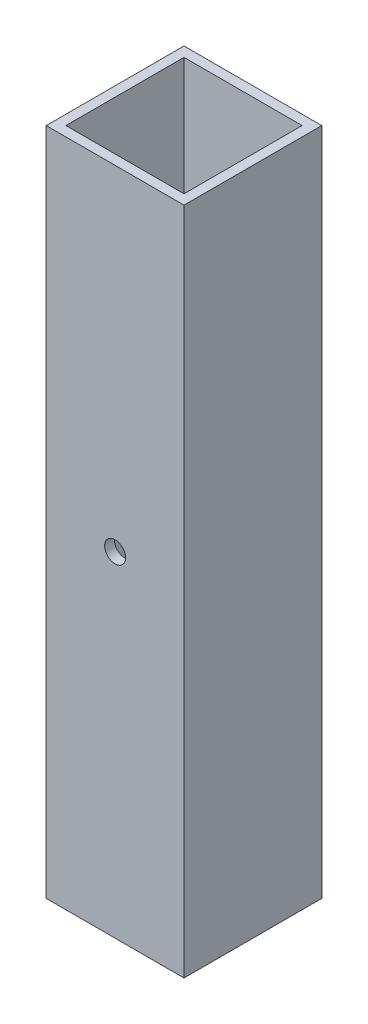
ISO-10303-21;
HEADER;
FILE_DESCRIPTION(('STEP AP214'),'2;1');
FILE_NAME('part.step','',(''),(''),'','','');
FILE_SCHEMA(('AUTOMOTIVE_DESIGN { 1 0 10303 214 1 1 1 1 }'));
ENDSEC;
DATA;
#1=APPLICATION_CONTEXT('core data for automotive mechanical design processes');
#2=APPLICATION_PROTOCOL_DEFINITION('international standard','automotive_design',2000,#1);
#3=PRODUCT_CONTEXT('',#1,'mechanical');
#4=PRODUCT('Part','Part','',(#3));
#5=PRODUCT_RELATED_PRODUCT_CATEGORY('part','',(#4));
#6=PRODUCT_DEFINITION_FORMATION('','',#4);
#7=PRODUCT_DEFINITION_CONTEXT('part definition',#1,'design');
#8=PRODUCT_DEFINITION('design','',#6,#7);
#9=PRODUCT_DEFINITION_SHAPE('','',#8);
#10=(LENGTH_UNIT() NAMED_UNIT(*) SI_UNIT(.MILLI.,.METRE.));
#11=(NAMED_UNIT(*) PLANE_ANGLE_UNIT() SI_UNIT($,.RADIAN.));
#12=(NAMED_UNIT(*) SI_UNIT($,.STERADIAN.) SOLID_ANGLE_UNIT());
#13=UNCERTAINTY_MEASURE_WITH_UNIT(LENGTH_MEASURE(1.E-05),#10,'distance_accuracy_value','');
#14=(GEOMETRIC_REPRESENTATION_CONTEXT(3) GLOBAL_UNCERTAINTY_ASSIGNED_CONTEXT((#13)) GLOBAL_UNIT_ASSIGNED_CONTEXT((#10,
#11,#12)) REPRESENTATION_CONTEXT('',''));
#15=CARTESIAN_POINT('',(0.,0.,0.));
#16=DIRECTION('',(0.,0.,1.));
#17=DIRECTION('',(1.,0.,0.));
#18=AXIS2_PLACEMENT_3D('',#15,#16,#17);
#19=CARTESIAN_POINT('',(22.225,260.35,-304.8));
#20=DIRECTION('',(0.,-1.,0.));
#21=DIRECTION('',(0.,0.,-1.));
#22=AXIS2_PLACEMENT_3D('',#19,#20,#21);
#23=PLANE('',#22);
#24=DIRECTION('',(1.,0.,0.));
#25=VECTOR('',#24,1.);
#26=CARTESIAN_POINT('',(22.225,260.35,-260.35));
#27=LINE('',#26,#25);
#28=CARTESIAN_POINT('',(0.,260.35,-260.35));
#29=VERTEX_POINT('',#28);
#30=CARTESIAN_POINT('',(44.45,260.35,-260.35));
#31=VERTEX_POINT('',#30);
#32=EDGE_CURVE('E168',#29,#31,#27,.T.);
#33=ORIENTED_EDGE('',*,*,#32,.T.);
#34=DIRECTION('',(0.,0.,1.));
#35=VECTOR('',#34,1.);
#36=CARTESIAN_POINT('',(44.45,260.35,-304.8));
#37=LINE('',#36,#35);
#38=CARTESIAN_POINT('',(44.45,260.35,-304.8));
#39=VERTEX_POINT('',#38);
#40=EDGE_CURVE('E177',#39,#31,#37,.T.);
#41=ORIENTED_EDGE('',*,*,#40,.F.);
#42=DIRECTION('',(1.,0.,0.));
#43=VECTOR('',#42,1.);
#44=CARTESIAN_POINT('',(22.225,260.35,-304.8));
#45=LINE('',#44,#43);
#46=CARTESIAN_POINT('',(0.,260.35,-304.8));
#47=VERTEX_POINT('',#46);
#48=EDGE_CURVE('E154',#47,#39,#45,.T.);
#49=ORIENTED_EDGE('',*,*,#48,.F.);
#50=DIRECTION('',(0.,0.,1.));
#51=VECTOR('',#50,1.);
#52=CARTESIAN_POINT('',(0.,260.35,-304.8));
#53=LINE('',#52,#51);
#54=EDGE_CURVE('E24',#47,#29,#53,.T.);
#55=ORIENTED_EDGE('',*,*,#54,.T.);
#56=EDGE_LOOP('',(#33,#41,#49,#55));
#57=FACE_BOUND('',#56,.T.);
#58=DIRECTION('',(1.,0.,0.));
#59=VECTOR('',#58,1.);
#60=CARTESIAN_POINT('',(22.225,260.35,-263.525));
#61=LINE('',#60,#59);
#62=CARTESIAN_POINT('',(3.175,260.35,-263.525));
#63=VERTEX_POINT('',#62);
#64=CARTESIAN_POINT('',(41.275,260.35,-263.525));
#65=VERTEX_POINT('',#64);
#66=EDGE_CURVE('E105',#63,#65,#61,.T.);
#67=ORIENTED_EDGE('',*,*,#66,.F.);
#68=DIRECTION('',(0.,0.,1.));
#69=VECTOR('',#68,1.);
#70=CARTESIAN_POINT('',(3.175,260.35,-304.8));
#71=LINE('',#70,#69);
#72=CARTESIAN_POINT('',(3.175,260.35,-301.625));
#73=VERTEX_POINT('',#72);
#74=EDGE_CURVE('E114',#73,#63,#71,.T.);
#75=ORIENTED_EDGE('',*,*,#74,.F.);
#76=DIRECTION('',(1.,0.,0.));
#77=VECTOR('',#76,1.);
#78=CARTESIAN_POINT('',(22.225,260.35,-301.625));
#79=LINE('',#78,#77);
#80=CARTESIAN_POINT('',(41.275,260.35,-301.625));
#81=VERTEX_POINT('',#80);
#82=EDGE_CURVE('E36',#73,#81,#79,.T.);
#83=ORIENTED_EDGE('',*,*,#82,.T.);
#84=DIRECTION('',(0.,0.,1.));
#85=VECTOR('',#84,1.);
#86=CARTESIAN_POINT('',(41.275,260.35,-304.8));
#87=LINE('',#86,#85);
#88=EDGE_CURVE('E120',#81,#65,#87,.T.);
#89=ORIENTED_EDGE('',*,*,#88,.T.);
#90=EDGE_LOOP('',(#67,#75,#83,#89));
#91=FACE_BOUND('',#90,.T.);
#92=ADVANCED_FACE('F14',(#57,#91),#23,.F.);
#93=CARTESIAN_POINT('',(22.225,44.45,-304.8));
#94=DIRECTION('',(0.,-1.,0.));
#95=DIRECTION('',(0.,0.,-1.));
#96=AXIS2_PLACEMENT_3D('',#93,#94,#95);
#97=PLANE('',#96);
#98=DIRECTION('',(1.,0.,0.));
#99=VECTOR('',#98,1.);
#100=CARTESIAN_POINT('',(22.225,44.45,-260.35));
#101=LINE('',#100,#99);
#102=CARTESIAN_POINT('',(0.,44.45,-260.35));
#103=VERTEX_POINT('',#102);
#104=CARTESIAN_POINT('',(44.45,44.45,-260.35));
#105=VERTEX_POINT('',#104);
#106=EDGE_CURVE('E139',#103,#105,#101,.T.);
#107=ORIENTED_EDGE('',*,*,#106,.F.);
#108=DIRECTION('',(0.,0.,1.));
#109=VECTOR('',#108,1.);
#110=CARTESIAN_POINT('',(0.,44.45,-304.8));
#111=LINE('',#110,#109);
#112=CARTESIAN_POINT('',(0.,44.45,-304.8));
#113=VERTEX_POINT('',#112);
#114=EDGE_CURVE('E9',#113,#103,#111,.T.);
#115=ORIENTED_EDGE('',*,*,#114,.F.);
#116=DIRECTION('',(1.,0.,0.));
#117=VECTOR('',#116,1.);
#118=CARTESIAN_POINT('',(22.225,44.45,-304.8));
#119=LINE('',#118,#117);
#120=CARTESIAN_POINT('',(44.45,44.45,-304.8));
#121=VERTEX_POINT('',#120);
#122=EDGE_CURVE('E146',#113,#121,#119,.T.);
#123=ORIENTED_EDGE('',*,*,#122,.T.);
#124=DIRECTION('',(0.,0.,1.));
#125=VECTOR('',#124,1.);
#126=CARTESIAN_POINT('',(44.45,44.45,-304.8));
#127=LINE('',#126,#125);
#128=EDGE_CURVE('E161',#121,#105,#127,.T.);
#129=ORIENTED_EDGE('',*,*,#128,.T.);
#130=EDGE_LOOP('',(#107,#115,#123,#129));
#131=FACE_BOUND('',#130,.T.);
#132=DIRECTION('',(0.,0.,1.));
#133=VECTOR('',#132,1.);
#134=CARTESIAN_POINT('',(3.175,44.45,-304.8));
#135=LINE('',#134,#133);
#136=CARTESIAN_POINT('',(3.175,44.45,-301.625));
#137=VERTEX_POINT('',#136);
#138=CARTESIAN_POINT('',(3.175,44.45,-263.525));
#139=VERTEX_POINT('',#138);
#140=EDGE_CURVE('E119',#137,#139,#135,.T.);
#141=ORIENTED_EDGE('',*,*,#140,.T.);
#142=DIRECTION('',(1.,0.,0.));
#143=VECTOR('',#142,1.);
#144=CARTESIAN_POINT('',(22.225,44.45,-263.525));
#145=LINE('',#144,#143);
#146=CARTESIAN_POINT('',(41.275,44.45,-263.525));
#147=VERTEX_POINT('',#146);
#148=EDGE_CURVE('E108',#139,#147,#145,.T.);
#149=ORIENTED_EDGE('',*,*,#148,.T.);
#150=DIRECTION('',(0.,0.,1.));
#151=VECTOR('',#150,1.);
#152=CARTESIAN_POINT('',(41.275,44.45,-304.8));
#153=LINE('',#152,#151);
#154=CARTESIAN_POINT('',(41.275,44.45,-301.625));
#155=VERTEX_POINT('',#154);
#156=EDGE_CURVE('E135',#155,#147,#153,.T.);
#157=ORIENTED_EDGE('',*,*,#156,.F.);
#158=DIRECTION('',(1.,0.,0.));
#159=VECTOR('',#158,1.);
#160=CARTESIAN_POINT('',(22.225,44.45,-301.625));
#161=LINE('',#160,#159);
#162=EDGE_CURVE('E130',#137,#155,#161,.T.);
#163=ORIENTED_EDGE('',*,*,#162,.F.);
#164=EDGE_LOOP('',(#141,#149,#157,#163));
#165=FACE_BOUND('',#164,.T.);
#166=ADVANCED_FACE('F16',(#131,#165),#97,.T.);
#167=CARTESIAN_POINT('',(0.,152.4,-304.8));
#168=DIRECTION('',(1.,0.,0.));
#169=DIRECTION('',(0.,0.,-1.));
#170=AXIS2_PLACEMENT_3D('',#167,#168,#169);
#171=PLANE('',#170);
#172=DIRECTION('',(0.,1.,0.));
#173=VECTOR('',#172,1.);
#174=CARTESIAN_POINT('',(0.,152.4,-260.35));
#175=LINE('',#174,#173);
#176=EDGE_CURVE('E165',#103,#29,#175,.T.);
#177=ORIENTED_EDGE('',*,*,#176,.T.);
#178=ORIENTED_EDGE('',*,*,#54,.F.);
#179=DIRECTION('',(0.,1.,0.));
#180=VECTOR('',#179,1.);
#181=CARTESIAN_POINT('',(0.,152.4,-304.8));
#182=LINE('',#181,#180);
#183=EDGE_CURVE('E150',#113,#47,#182,.T.);
#184=ORIENTED_EDGE('',*,*,#183,.F.);
#185=ORIENTED_EDGE('',*,*,#114,.T.);
#186=EDGE_LOOP('',(#177,#178,#184,#185));
#187=FACE_BOUND('',#186,.T.);
#188=ADVANCED_FACE('F201',(#187),#171,.F.);
#189=CARTESIAN_POINT('',(44.45,152.4,-304.8));
#190=DIRECTION('',(1.,0.,0.));
#191=DIRECTION('',(0.,0.,-1.));
#192=AXIS2_PLACEMENT_3D('',#189,#190,#191);
#193=PLANE('',#192);
#194=DIRECTION('',(0.,1.,0.));
#195=VECTOR('',#194,1.);
#196=CARTESIAN_POINT('',(44.45,152.4,-260.35));
#197=LINE('',#196,#195);
#198=EDGE_CURVE('E151',#105,#31,#197,.T.);
#199=ORIENTED_EDGE('',*,*,#198,.F.);
#200=ORIENTED_EDGE('',*,*,#128,.F.);
#201=DIRECTION('',(0.,1.,0.));
#202=VECTOR('',#201,1.);
#203=CARTESIAN_POINT('',(44.45,152.4,-304.8));
#204=LINE('',#203,#202);
#205=EDGE_CURVE('E157',#121,#39,#204,.T.);
#206=ORIENTED_EDGE('',*,*,#205,.T.);
#207=ORIENTED_EDGE('',*,*,#40,.T.);
#208=EDGE_LOOP('',(#199,#200,#206,#207));
#209=FACE_BOUND('',#208,.T.);
#210=ADVANCED_FACE('F196',(#209),#193,.T.);
#211=CARTESIAN_POINT('',(22.225,152.4,-304.8));
#212=DIRECTION('',(0.,0.,-1.));
#213=DIRECTION('',(1.,0.,0.));
#214=AXIS2_PLACEMENT_3D('',#211,#212,#213);
#215=PLANE('',#214);
#216=CARTESIAN_POINT('',(22.225,152.4,-304.8));
#217=DIRECTION('',(0.,0.,-1.));
#218=DIRECTION('',(-1.,0.,0.));
#219=AXIS2_PLACEMENT_3D('',#216,#217,#218);
#220=CIRCLE('',#219,3.3782);
#221=CARTESIAN_POINT('',(18.8468,152.4,-304.8));
#222=VERTEX_POINT('',#221);
#223=EDGE_CURVE('E145',#222,#222,#220,.F.);
#224=ORIENTED_EDGE('',*,*,#223,.T.);
#225=EDGE_LOOP('',(#224));
#226=FACE_BOUND('',#225,.T.);
#227=ORIENTED_EDGE('',*,*,#122,.F.);
#228=ORIENTED_EDGE('',*,*,#183,.T.);
#229=ORIENTED_EDGE('',*,*,#48,.T.);
#230=ORIENTED_EDGE('',*,*,#205,.F.);
#231=EDGE_LOOP('',(#227,#228,#229,#230));
#232=FACE_BOUND('',#231,.T.);
#233=ADVANCED_FACE('F200',(#226,#232),#215,.T.);
#234=CARTESIAN_POINT('',(22.225,152.4,-260.35));
#235=DIRECTION('',(0.,0.,-1.));
#236=DIRECTION('',(1.,0.,0.));
#237=AXIS2_PLACEMENT_3D('',#234,#235,#236);
#238=PLANE('',#237);
#239=CARTESIAN_POINT('',(22.225,152.4,-260.35));
#240=DIRECTION('',(0.,0.,1.));
#241=DIRECTION('',(1.,0.,0.));
#242=AXIS2_PLACEMENT_3D('',#239,#240,#241);
#243=CIRCLE('',#242,3.3782);
#244=CARTESIAN_POINT('',(25.6032,152.4,-260.35));
#245=VERTEX_POINT('',#244);
#246=EDGE_CURVE('E254',#245,#245,#243,.T.);
#247=ORIENTED_EDGE('',*,*,#246,.F.);
#248=EDGE_LOOP('',(#247));
#249=FACE_BOUND('',#248,.T.);
#250=ORIENTED_EDGE('',*,*,#106,.T.);
#251=ORIENTED_EDGE('',*,*,#198,.T.);
#252=ORIENTED_EDGE('',*,*,#32,.F.);
#253=ORIENTED_EDGE('',*,*,#176,.F.);
#254=EDGE_LOOP('',(#250,#251,#252,#253));
#255=FACE_BOUND('',#254,.T.);
#256=ADVANCED_FACE('F192',(#249,#255),#238,.F.);
#257=CARTESIAN_POINT('',(3.175,152.4,-304.8));
#258=DIRECTION('',(1.,0.,0.));
#259=DIRECTION('',(0.,0.,-1.));
#260=AXIS2_PLACEMENT_3D('',#257,#258,#259);
#261=PLANE('',#260);
#262=DIRECTION('',(0.,1.,0.));
#263=VECTOR('',#262,1.);
#264=CARTESIAN_POINT('',(3.175,152.4,-263.525));
#265=LINE('',#264,#263);
#266=EDGE_CURVE('E100',#139,#63,#265,.T.);
#267=ORIENTED_EDGE('',*,*,#266,.F.);
#268=ORIENTED_EDGE('',*,*,#140,.F.);
#269=DIRECTION('',(0.,1.,0.));
#270=VECTOR('',#269,1.);
#271=CARTESIAN_POINT('',(3.175,152.4,-301.625));
#272=LINE('',#271,#270);
#273=EDGE_CURVE('E116',#137,#73,#272,.T.);
#274=ORIENTED_EDGE('',*,*,#273,.T.);
#275=ORIENTED_EDGE('',*,*,#74,.T.);
#276=EDGE_LOOP('',(#267,#268,#274,#275));
#277=FACE_BOUND('',#276,.T.);
#278=ADVANCED_FACE('F115',(#277),#261,.T.);
#279=CARTESIAN_POINT('',(41.275,152.4,-304.8));
#280=DIRECTION('',(1.,0.,0.));
#281=DIRECTION('',(0.,0.,-1.));
#282=AXIS2_PLACEMENT_3D('',#279,#280,#281);
#283=PLANE('',#282);
#284=DIRECTION('',(0.,1.,0.));
#285=VECTOR('',#284,1.);
#286=CARTESIAN_POINT('',(41.275,152.4,-263.525));
#287=LINE('',#286,#285);
#288=EDGE_CURVE('E124',#147,#65,#287,.T.);
#289=ORIENTED_EDGE('',*,*,#288,.T.);
#290=ORIENTED_EDGE('',*,*,#88,.F.);
#291=DIRECTION('',(0.,1.,0.));
#292=VECTOR('',#291,1.);
#293=CARTESIAN_POINT('',(41.275,152.4,-301.625));
#294=LINE('',#293,#292);
#295=EDGE_CURVE('E46',#155,#81,#294,.T.);
#296=ORIENTED_EDGE('',*,*,#295,.F.);
#297=ORIENTED_EDGE('',*,*,#156,.T.);
#298=EDGE_LOOP('',(#289,#290,#296,#297));
#299=FACE_BOUND('',#298,.T.);
#300=ADVANCED_FACE('F223',(#299),#283,.F.);
#301=CARTESIAN_POINT('',(22.225,152.4,-301.625));
#302=DIRECTION('',(0.,0.,-1.));
#303=DIRECTION('',(1.,0.,0.));
#304=AXIS2_PLACEMENT_3D('',#301,#302,#303);
#305=PLANE('',#304);
#306=CARTESIAN_POINT('',(22.225,152.4,-301.625));
#307=DIRECTION('',(0.,0.,-1.));
#308=DIRECTION('',(-1.,0.,0.));
#309=AXIS2_PLACEMENT_3D('',#306,#307,#308);
#310=CIRCLE('',#309,3.3782);
#311=CARTESIAN_POINT('',(18.8468,152.4,-301.625));
#312=VERTEX_POINT('',#311);
#313=EDGE_CURVE('E299',#312,#312,#310,.F.);
#314=ORIENTED_EDGE('',*,*,#313,.F.);
#315=EDGE_LOOP('',(#314));
#316=FACE_BOUND('',#315,.T.);
#317=ORIENTED_EDGE('',*,*,#162,.T.);
#318=ORIENTED_EDGE('',*,*,#295,.T.);
#319=ORIENTED_EDGE('',*,*,#82,.F.);
#320=ORIENTED_EDGE('',*,*,#273,.F.);
#321=EDGE_LOOP('',(#317,#318,#319,#320));
#322=FACE_BOUND('',#321,.T.);
#323=ADVANCED_FACE('F207',(#316,#322),#305,.F.);
#324=CARTESIAN_POINT('',(22.225,152.4,-263.525));
#325=DIRECTION('',(0.,0.,-1.));
#326=DIRECTION('',(1.,0.,0.));
#327=AXIS2_PLACEMENT_3D('',#324,#325,#326);
#328=PLANE('',#327);
#329=CARTESIAN_POINT('',(22.225,152.4,-263.525));
#330=DIRECTION('',(0.,0.,-1.));
#331=DIRECTION('',(-1.,0.,0.));
#332=AXIS2_PLACEMENT_3D('',#329,#330,#331);
#333=CIRCLE('',#332,3.3782);
#334=CARTESIAN_POINT('',(18.8468,152.4,-263.525));
#335=VERTEX_POINT('',#334);
#336=EDGE_CURVE('E18',#335,#335,#333,.F.);
#337=ORIENTED_EDGE('',*,*,#336,.T.);
#338=EDGE_LOOP('',(#337));
#339=FACE_BOUND('',#338,.T.);
#340=ORIENTED_EDGE('',*,*,#148,.F.);
#341=ORIENTED_EDGE('',*,*,#266,.T.);
#342=ORIENTED_EDGE('',*,*,#66,.T.);
#343=ORIENTED_EDGE('',*,*,#288,.F.);
#344=EDGE_LOOP('',(#340,#341,#342,#343));
#345=FACE_BOUND('',#344,.T.);
#346=ADVANCED_FACE('F102',(#339,#345),#328,.T.);
#347=CARTESIAN_POINT('',(22.225,152.4,-486.230240033847));
#348=DIRECTION('',(0.,0.,1.));
#349=DIRECTION('',(1.,0.,0.));
#350=AXIS2_PLACEMENT_3D('',#347,#348,#349);
#351=CYLINDRICAL_SURFACE('',#350,3.3782);
#352=ORIENTED_EDGE('',*,*,#336,.F.);
#353=EDGE_LOOP('',(#352));
#354=FACE_BOUND('',#353,.T.);
#355=ORIENTED_EDGE('',*,*,#246,.T.);
#356=EDGE_LOOP('',(#355));
#357=FACE_BOUND('',#356,.T.);
#358=ADVANCED_FACE('F281',(#354,#357),#351,.F.);
#359=ORIENTED_EDGE('',*,*,#223,.F.);
#360=EDGE_LOOP('',(#359));
#361=FACE_BOUND('',#360,.T.);
#362=ORIENTED_EDGE('',*,*,#313,.T.);
#363=EDGE_LOOP('',(#362));
#364=FACE_BOUND('',#363,.T.);
#365=ADVANCED_FACE('F310',(#361,#364),#351,.F.);
#366=CLOSED_SHELL('',(#92,#166,#188,#210,#233,#256,#278,#300,#323,#346,#358,#365));
#367=MANIFOLD_SOLID_BREP('B1',#366);
#368=ADVANCED_BREP_SHAPE_REPRESENTATION('',(#18,#367),#14);
#369=SHAPE_DEFINITION_REPRESENTATION(#9,#368);
ENDSEC;
END-ISO-10303-21;
